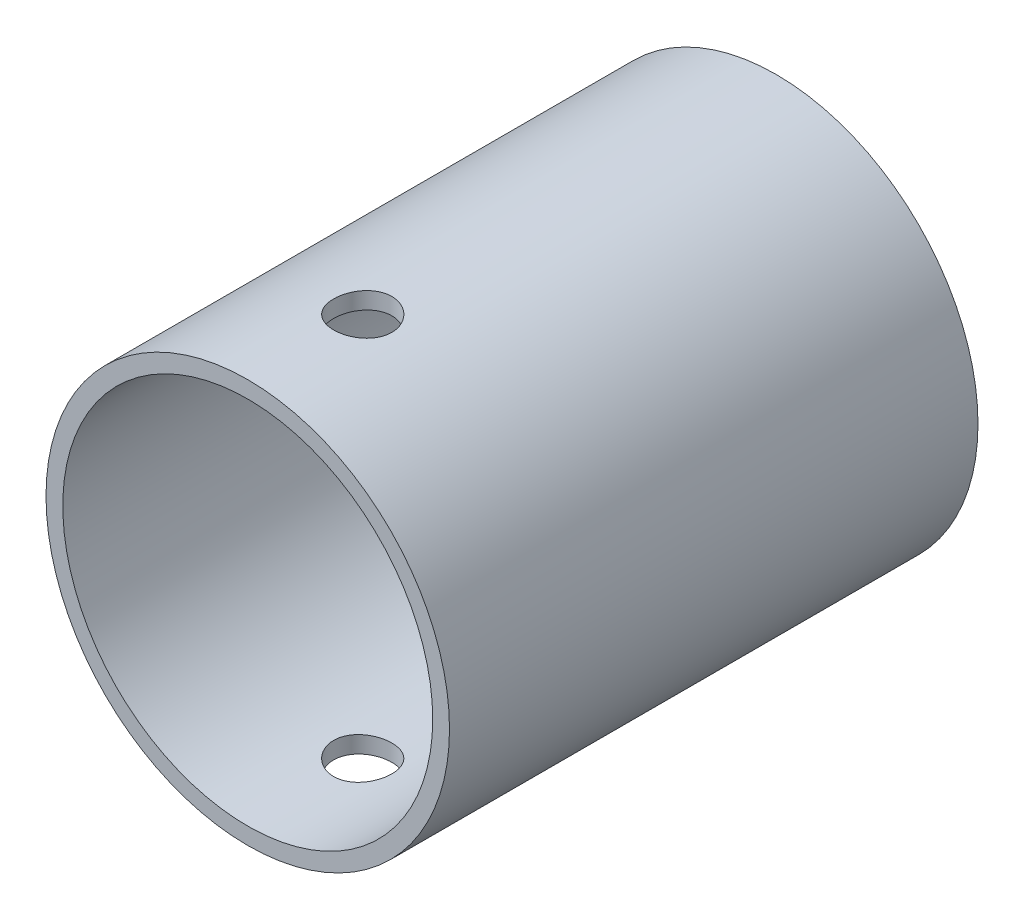
ISO-10303-21;
HEADER;
FILE_DESCRIPTION(('STEP AP214'),'2;1');
FILE_NAME('part.step','',(''),(''),'','','');
FILE_SCHEMA(('AUTOMOTIVE_DESIGN { 1 0 10303 214 1 1 1 1 }'));
ENDSEC;
DATA;
#1=APPLICATION_CONTEXT('core data for automotive mechanical design processes');
#2=APPLICATION_PROTOCOL_DEFINITION('international standard','automotive_design',2000,#1);
#3=PRODUCT_CONTEXT('',#1,'mechanical');
#4=PRODUCT('Part','Part','',(#3));
#5=PRODUCT_RELATED_PRODUCT_CATEGORY('part','',(#4));
#6=PRODUCT_DEFINITION_FORMATION('','',#4);
#7=PRODUCT_DEFINITION_CONTEXT('part definition',#1,'design');
#8=PRODUCT_DEFINITION('design','',#6,#7);
#9=PRODUCT_DEFINITION_SHAPE('','',#8);
#10=(LENGTH_UNIT() NAMED_UNIT(*) SI_UNIT(.MILLI.,.METRE.));
#11=(NAMED_UNIT(*) PLANE_ANGLE_UNIT() SI_UNIT($,.RADIAN.));
#12=(NAMED_UNIT(*) SI_UNIT($,.STERADIAN.) SOLID_ANGLE_UNIT());
#13=UNCERTAINTY_MEASURE_WITH_UNIT(LENGTH_MEASURE(1.E-05),#10,'distance_accuracy_value','');
#14=(GEOMETRIC_REPRESENTATION_CONTEXT(3) GLOBAL_UNCERTAINTY_ASSIGNED_CONTEXT((#13)) GLOBAL_UNIT_ASSIGNED_CONTEXT((#10,
#11,#12)) REPRESENTATION_CONTEXT('',''));
#15=CARTESIAN_POINT('',(0.,0.,0.));
#16=DIRECTION('',(0.,0.,1.));
#17=DIRECTION('',(1.,0.,0.));
#18=AXIS2_PLACEMENT_3D('',#15,#16,#17);
#19=CARTESIAN_POINT('',(0.,0.,6.));
#20=DIRECTION('',(0.,0.,1.));
#21=DIRECTION('',(1.,0.,0.));
#22=AXIS2_PLACEMENT_3D('',#19,#20,#21);
#23=PLANE('',#22);
#24=CARTESIAN_POINT('',(0.,0.,6.));
#25=DIRECTION('',(0.,0.,1.));
#26=DIRECTION('',(1.,0.,0.));
#27=AXIS2_PLACEMENT_3D('',#24,#25,#26);
#28=CIRCLE('',#27,9.);
#29=CARTESIAN_POINT('',(9.,0.,6.));
#30=VERTEX_POINT('',#29);
#31=EDGE_CURVE('E141',#30,#30,#28,.T.);
#32=ORIENTED_EDGE('',*,*,#31,.F.);
#33=EDGE_LOOP('',(#32));
#34=FACE_BOUND('',#33,.T.);
#35=CARTESIAN_POINT('',(0.,0.,6.));
#36=DIRECTION('',(0.,0.,1.));
#37=DIRECTION('',(1.,0.,0.));
#38=AXIS2_PLACEMENT_3D('',#35,#36,#37);
#39=CIRCLE('',#38,10.);
#40=CARTESIAN_POINT('',(10.,0.,6.));
#41=VERTEX_POINT('',#40);
#42=EDGE_CURVE('E61',#41,#41,#39,.F.);
#43=ORIENTED_EDGE('',*,*,#42,.F.);
#44=EDGE_LOOP('',(#43));
#45=FACE_BOUND('',#44,.T.);
#46=ADVANCED_FACE('F36',(#34,#45),#23,.T.);
#47=CARTESIAN_POINT('',(0.,0.,5.));
#48=DIRECTION('',(0.,0.,-1.));
#49=DIRECTION('',(-1.,0.,0.));
#50=AXIS2_PLACEMENT_3D('',#47,#48,#49);
#51=PLANE('',#50);
#52=CARTESIAN_POINT('',(0.,0.,5.));
#53=DIRECTION('',(0.,0.,-1.));
#54=DIRECTION('',(-1.,0.,0.));
#55=AXIS2_PLACEMENT_3D('',#52,#53,#54);
#56=CIRCLE('',#55,6.);
#57=CARTESIAN_POINT('',(-6.,0.,5.));
#58=VERTEX_POINT('',#57);
#59=EDGE_CURVE('E136',#58,#58,#56,.T.);
#60=ORIENTED_EDGE('',*,*,#59,.T.);
#61=EDGE_LOOP('',(#60));
#62=FACE_BOUND('',#61,.T.);
#63=CARTESIAN_POINT('',(0.,0.,5.));
#64=DIRECTION('',(0.,0.,1.));
#65=DIRECTION('',(1.,0.,0.));
#66=AXIS2_PLACEMENT_3D('',#63,#64,#65);
#67=CIRCLE('',#66,9.);
#68=CARTESIAN_POINT('',(9.,0.,5.));
#69=VERTEX_POINT('',#68);
#70=EDGE_CURVE('E149',#69,#69,#67,.T.);
#71=ORIENTED_EDGE('',*,*,#70,.T.);
#72=EDGE_LOOP('',(#71));
#73=FACE_BOUND('',#72,.T.);
#74=ADVANCED_FACE('F100',(#62,#73),#51,.F.);
#75=CARTESIAN_POINT('',(0.,0.,50.));
#76=DIRECTION('',(0.,0.,-1.));
#77=DIRECTION('',(-1.,0.,0.));
#78=AXIS2_PLACEMENT_3D('',#75,#76,#77);
#79=CYLINDRICAL_SURFACE('',#78,17.5);
#80=CARTESIAN_POINT('',(0.,-17.5,41.8700003922223));
#81=CARTESIAN_POINT('',(0.153455229582551,-17.4999974630045,41.8699941337384));
#82=CARTESIAN_POINT('',(0.306997303591635,-17.4979604565219,41.8571123767081));
#83=CARTESIAN_POINT('',(0.609783625449626,-17.4900305238574,41.8059422330934));
#84=CARTESIAN_POINT('',(0.759023644274631,-17.4841339300814,41.767629680265));
#85=CARTESIAN_POINT('',(1.04878062656791,-17.469146941984,41.6667761464509));
#86=CARTESIAN_POINT('',(1.18930431030421,-17.4600590450865,41.6042541072099));
#87=CARTESIAN_POINT('',(1.4578461688781,-17.4396915891876,41.4568040653463));
#88=CARTESIAN_POINT('',(1.58586594948107,-17.4284123121633,41.3718789449507));
#89=CARTESIAN_POINT('',(1.82687936824554,-17.4048070423709,41.1812611533715));
#90=CARTESIAN_POINT('',(1.93975072674967,-17.3924737106769,41.0754147665861));
#91=CARTESIAN_POINT('',(2.14620776085764,-17.368207284657,40.8462898676752));
#92=CARTESIAN_POINT('',(2.23979228333447,-17.3562742142977,40.723010313993));
#93=CARTESIAN_POINT('',(2.40550105052376,-17.3340882849669,40.4616891842459));
#94=CARTESIAN_POINT('',(2.47750588810652,-17.3238449109296,40.323571014526));
#95=CARTESIAN_POINT('',(2.59724804353714,-17.3062990761218,40.0370128344823));
#96=CARTESIAN_POINT('',(2.64498681482154,-17.2989964392188,39.8885734429624));
#97=CARTESIAN_POINT('',(2.71445962258402,-17.2882314601016,39.5868768602009));
#98=CARTESIAN_POINT('',(2.73640375950366,-17.2847381079426,39.4336691765623));
#99=CARTESIAN_POINT('',(2.75431548537907,-17.281893232641,39.12570940022));
#100=CARTESIAN_POINT('',(2.75028470959802,-17.2825414487639,38.9709574053517));
#101=CARTESIAN_POINT('',(2.71653249105086,-17.2878781308041,38.665792501426));
#102=CARTESIAN_POINT('',(2.68704588428737,-17.2925296639804,38.5153528794389));
#103=CARTESIAN_POINT('',(2.60358701785442,-17.3052911276942,38.221583204165));
#104=CARTESIAN_POINT('',(2.54961400397372,-17.3134011647574,38.0782533700192));
#105=CARTESIAN_POINT('',(2.41847274313756,-17.3322062618977,37.8020621568788));
#106=CARTESIAN_POINT('',(2.3412058407861,-17.3429122780869,37.669248398068));
#107=CARTESIAN_POINT('',(2.16574029562039,-17.3656952499611,37.4183824011052));
#108=CARTESIAN_POINT('',(2.06754014737257,-17.3777723042165,37.3003312255872));
#109=CARTESIAN_POINT('',(1.85171057236304,-17.4020993832948,37.0809811054065));
#110=CARTESIAN_POINT('',(1.7338794134433,-17.4143498500481,36.979880598823));
#111=CARTESIAN_POINT('',(1.48281796103276,-17.4375203725031,36.798858256409));
#112=CARTESIAN_POINT('',(1.34958758767357,-17.4484404213039,36.7189365304298));
#113=CARTESIAN_POINT('',(1.07133156137927,-17.4677327717946,36.5825269724027));
#114=CARTESIAN_POINT('',(0.926297820339916,-17.4761033075165,36.5260553737314));
#115=CARTESIAN_POINT('',(0.628644132738795,-17.4893389966959,36.4383264400927));
#116=CARTESIAN_POINT('',(0.476024750473814,-17.4942044104837,36.4070672325438));
#117=CARTESIAN_POINT('',(0.169243780415673,-17.4998469580502,36.3709164208083));
#118=CARTESIAN_POINT('',(0.0151150703929344,-17.5006663632781,36.3657521711964));
#119=CARTESIAN_POINT('',(-0.29180648376779,-17.4982399319457,36.3812128531373));
#120=CARTESIAN_POINT('',(-0.4445993732436,-17.4949942338987,36.401836905985));
#121=CARTESIAN_POINT('',(-0.743679422530946,-17.4848284353516,36.4680620039074));
#122=CARTESIAN_POINT('',(-0.889996919858359,-17.4779280136421,36.5135293219911));
#123=CARTESIAN_POINT('',(-1.17293227179733,-17.4612237098417,36.628008640138));
#124=CARTESIAN_POINT('',(-1.30954963259971,-17.4514196800667,36.697021837825));
#125=CARTESIAN_POINT('',(-1.57039946776912,-17.4298918578239,36.8572671921913));
#126=CARTESIAN_POINT('',(-1.69452514146822,-17.4181534584848,36.9486712014796));
#127=CARTESIAN_POINT('',(-1.92577278652917,-17.3941064929383,37.1508654890616));
#128=CARTESIAN_POINT('',(-2.03289366682977,-17.3817978902109,37.2616570103385));
#129=CARTESIAN_POINT('',(-2.22809077542299,-17.3578626272195,37.5006989512705));
#130=CARTESIAN_POINT('',(-2.31598362633745,-17.3462432437313,37.6290999545737));
#131=CARTESIAN_POINT('',(-2.46895256595108,-17.3251337935183,37.8990037750657));
#132=CARTESIAN_POINT('',(-2.53402931720837,-17.3156436649648,38.0405062116502));
#133=CARTESIAN_POINT('',(-2.63923867768394,-17.2999207265537,38.3320635521373));
#134=CARTESIAN_POINT('',(-2.67946560939592,-17.2936756141117,38.4820837264695));
#135=CARTESIAN_POINT('',(-2.73413229043844,-17.285117855811,38.7868569262007));
#136=CARTESIAN_POINT('',(-2.74857401062851,-17.2828049094027,38.9416095889583));
#137=CARTESIAN_POINT('',(-2.75121005923864,-17.2823853149773,39.2496257804446));
#138=CARTESIAN_POINT('',(-2.73969283943861,-17.2842324406975,39.4028868548955));
#139=CARTESIAN_POINT('',(-2.69135840320221,-17.2918240499717,39.7052627646104));
#140=CARTESIAN_POINT('',(-2.65454124370756,-17.297568524754,39.8543776092054));
#141=CARTESIAN_POINT('',(-2.55675761537021,-17.3122908254171,40.1441351076097));
#142=CARTESIAN_POINT('',(-2.49581326154319,-17.3212656896368,40.2847853844235));
#143=CARTESIAN_POINT('',(-2.35153428014303,-17.3414408094226,40.5539115750985));
#144=CARTESIAN_POINT('',(-2.2681987464252,-17.3526411550466,40.6823869959729));
#145=CARTESIAN_POINT('',(-2.08046265805288,-17.3761530141985,40.9249787203767));
#146=CARTESIAN_POINT('',(-1.97584903731687,-17.3884750087046,41.0389291422424));
#147=CARTESIAN_POINT('',(-1.74897653539545,-17.4127559241292,41.2477584911066));
#148=CARTESIAN_POINT('',(-1.62671357218263,-17.4247147602782,41.3426329939518));
#149=CARTESIAN_POINT('',(-1.36713472210832,-17.4470054845769,41.5111377614422));
#150=CARTESIAN_POINT('',(-1.22973187787683,-17.4573270446582,41.5846354278861));
#151=CARTESIAN_POINT('',(-0.944429950548835,-17.4750794072139,41.7073966727562));
#152=CARTESIAN_POINT('',(-0.796541742404635,-17.4825131544018,41.7566849512202));
#153=CARTESIAN_POINT('',(-0.540021805161799,-17.491986366102,41.8186469990022));
#154=CARTESIAN_POINT('',(-0.432960829499724,-17.4949757850587,41.837874509043));
#155=CARTESIAN_POINT('',(-0.217281069280105,-17.4989834861277,41.8635533300353));
#156=CARTESIAN_POINT('',(-0.108662307045458,-17.5000017964574,41.8700048238817));
#157=CARTESIAN_POINT('',(0.,-17.5,41.8700003922223));
#158=B_SPLINE_CURVE_WITH_KNOTS('',3,(#80,#81,#82,#83,#84,#85,#86,#87,#88,#89,#90,#91,#92,#93,
#94,#95,#96,#97,#98,#99,#100,#101,#102,#103,#104,#105,#106,#107,#108,#109,#110,#111,#112,#113,
#114,#115,#116,#117,#118,#119,#120,#121,#122,#123,#124,#125,#126,#127,#128,#129,#130,#131,#132,
#133,#134,#135,#136,#137,#138,#139,#140,#141,#142,#143,#144,#145,#146,#147,#148,#149,#150,#151,
#152,#153,#154,#155,#156,#157),.UNSPECIFIED.,.T.,.F.,(4,2,2,2,2,2,2,2,2,2,2,2,2,2,2,2,2,2,2,2,2,
2,2,2,2,2,2,2,2,2,2,2,2,2,2,2,2,2,4),(0.,0.459968572164253,0.920374867822618,1.38042166249811,
1.84040929954923,2.30391144436546,2.76744129314947,3.2334905525743,3.69951189429492,
4.1617105385927,4.62388008523577,5.08183102452064,5.5397960702116,5.99972863003873,
6.45969427750327,6.92471667887331,7.38974149220079,7.85508768497432,8.320399312248,
8.78083906741796,9.24126313409204,9.69923288986304,10.1572259430135,10.6188507976519,
11.0805052590953,11.546387163941,12.0122555388924,12.4763445730229,12.9403981335855,
13.3993206543928,13.8582421423223,14.3167439525829,14.7752643206676,15.2386245857692,
15.7020921913456,16.1683761500298,16.6341833812816,16.9598937651968,17.2855994863752),.UNSPECIFIED.);
#159=CARTESIAN_POINT('',(0.,-17.5,41.8700003922223));
#160=VERTEX_POINT('',#159);
#161=EDGE_CURVE('E89',#160,#160,#158,.T.);
#162=ORIENTED_EDGE('',*,*,#161,.F.);
#163=EDGE_LOOP('',(#162));
#164=FACE_BOUND('',#163,.T.);
#165=CARTESIAN_POINT('',(0.,17.5,36.3700003922224));
#166=CARTESIAN_POINT('',(0.153455229582551,17.4999974630045,36.3700066507063));
#167=CARTESIAN_POINT('',(0.306997303591635,17.4979604565219,36.3828884077366));
#168=CARTESIAN_POINT('',(0.609783625449626,17.4900305238574,36.4340585513513));
#169=CARTESIAN_POINT('',(0.759023644274631,17.4841339300814,36.4723711041797));
#170=CARTESIAN_POINT('',(1.04878062656791,17.469146941984,36.5732246379938));
#171=CARTESIAN_POINT('',(1.18930431030421,17.4600590450865,36.6357466772348));
#172=CARTESIAN_POINT('',(1.4578461688781,17.4396915891876,36.7831967190983));
#173=CARTESIAN_POINT('',(1.58586594948107,17.4284123121633,36.868121839494));
#174=CARTESIAN_POINT('',(1.82687936824554,17.4048070423709,37.0587396310732));
#175=CARTESIAN_POINT('',(1.93975072674967,17.3924737106769,37.1645860178586));
#176=CARTESIAN_POINT('',(2.14620776085764,17.368207284657,37.3937109167695));
#177=CARTESIAN_POINT('',(2.23979228333447,17.3562742142977,37.5169904704517));
#178=CARTESIAN_POINT('',(2.40550105052376,17.3340882849669,37.7783116001988));
#179=CARTESIAN_POINT('',(2.47750588810652,17.3238449109296,37.9164297699187));
#180=CARTESIAN_POINT('',(2.59724804353714,17.3062990761218,38.2029879499624));
#181=CARTESIAN_POINT('',(2.64498681482154,17.2989964392188,38.3514273414823));
#182=CARTESIAN_POINT('',(2.71445962258402,17.2882314601016,38.6531239242438));
#183=CARTESIAN_POINT('',(2.73640375950366,17.2847381079426,38.8063316078824));
#184=CARTESIAN_POINT('',(2.75431548537907,17.281893232641,39.1142913842247));
#185=CARTESIAN_POINT('',(2.75028470959802,17.2825414487639,39.269043379093));
#186=CARTESIAN_POINT('',(2.71653249105086,17.2878781308041,39.5742082830187));
#187=CARTESIAN_POINT('',(2.68704588428737,17.2925296639804,39.7246479050058));
#188=CARTESIAN_POINT('',(2.60358701785442,17.3052911276942,40.0184175802797));
#189=CARTESIAN_POINT('',(2.54961400397372,17.3134011647574,40.1617474144255));
#190=CARTESIAN_POINT('',(2.41847274313756,17.3322062618977,40.4379386275659));
#191=CARTESIAN_POINT('',(2.3412058407861,17.3429122780869,40.5707523863767));
#192=CARTESIAN_POINT('',(2.16574029562039,17.3656952499611,40.8216183833395));
#193=CARTESIAN_POINT('',(2.06754014737257,17.3777723042165,40.9396695588575));
#194=CARTESIAN_POINT('',(1.85171057236304,17.4020993832948,41.1590196790382));
#195=CARTESIAN_POINT('',(1.7338794134433,17.4143498500481,41.2601201856217));
#196=CARTESIAN_POINT('',(1.48281796103276,17.4375203725031,41.4411425280357));
#197=CARTESIAN_POINT('',(1.34958758767357,17.4484404213039,41.5210642540149));
#198=CARTESIAN_POINT('',(1.07133156137927,17.4677327717946,41.657473812042));
#199=CARTESIAN_POINT('',(0.926297820339916,17.4761033075165,41.7139454107133));
#200=CARTESIAN_POINT('',(0.628644132738795,17.4893389966959,41.801674344352));
#201=CARTESIAN_POINT('',(0.476024750473814,17.4942044104837,41.8329335519009));
#202=CARTESIAN_POINT('',(0.169243780415673,17.4998469580502,41.8690843636364));
#203=CARTESIAN_POINT('',(0.0151150703929341,17.5006663632781,41.8742486132482));
#204=CARTESIAN_POINT('',(-0.29180648376779,17.4982399319457,41.8587879313074));
#205=CARTESIAN_POINT('',(-0.4445993732436,17.4949942338987,41.8381638784597));
#206=CARTESIAN_POINT('',(-0.743679422530946,17.4848284353516,41.7719387805373));
#207=CARTESIAN_POINT('',(-0.889996919858359,17.4779280136421,41.7264714624536));
#208=CARTESIAN_POINT('',(-1.17293227179733,17.4612237098417,41.6119921443067));
#209=CARTESIAN_POINT('',(-1.30954963259971,17.4514196800667,41.5429789466197));
#210=CARTESIAN_POINT('',(-1.57039946776912,17.4298918578239,41.3827335922534));
#211=CARTESIAN_POINT('',(-1.69452514146822,17.4181534584848,41.2913295829651));
#212=CARTESIAN_POINT('',(-1.92577278652918,17.3941064929383,41.0891352953831));
#213=CARTESIAN_POINT('',(-2.03289366682977,17.3817978902109,40.9783437741062));
#214=CARTESIAN_POINT('',(-2.22809077542299,17.3578626272195,40.7393018331742));
#215=CARTESIAN_POINT('',(-2.31598362633745,17.3462432437313,40.610900829871));
#216=CARTESIAN_POINT('',(-2.46895256595108,17.3251337935183,40.340997009379));
#217=CARTESIAN_POINT('',(-2.53402931720837,17.3156436649648,40.1994945727945));
#218=CARTESIAN_POINT('',(-2.63923867768394,17.2999207265537,39.9079372323074));
#219=CARTESIAN_POINT('',(-2.67946560939592,17.2936756141117,39.7579170579752));
#220=CARTESIAN_POINT('',(-2.73413229043844,17.285117855811,39.453143858244));
#221=CARTESIAN_POINT('',(-2.74857401062851,17.2828049094027,39.2983911954864));
#222=CARTESIAN_POINT('',(-2.75121005923864,17.2823853149773,38.9903750040001));
#223=CARTESIAN_POINT('',(-2.73969283943861,17.2842324406975,38.8371139295492));
#224=CARTESIAN_POINT('',(-2.69135840320221,17.2918240499717,38.5347380198343));
#225=CARTESIAN_POINT('',(-2.65454124370756,17.297568524754,38.3856231752393));
#226=CARTESIAN_POINT('',(-2.55675761537021,17.3122908254171,38.095865676835));
#227=CARTESIAN_POINT('',(-2.49581326154319,17.3212656896368,37.9552154000212));
#228=CARTESIAN_POINT('',(-2.35153428014303,17.3414408094226,37.6860892093462));
#229=CARTESIAN_POINT('',(-2.2681987464252,17.3526411550466,37.5576137884718));
#230=CARTESIAN_POINT('',(-2.08046265805288,17.3761530141985,37.315022064068));
#231=CARTESIAN_POINT('',(-1.97584903731687,17.3884750087046,37.2010716422023));
#232=CARTESIAN_POINT('',(-1.74897653539545,17.4127559241292,36.9922422933381));
#233=CARTESIAN_POINT('',(-1.62671357218263,17.4247147602782,36.8973677904929));
#234=CARTESIAN_POINT('',(-1.36713472210832,17.4470054845769,36.7288630230025));
#235=CARTESIAN_POINT('',(-1.22973187787683,17.4573270446582,36.6553653565586));
#236=CARTESIAN_POINT('',(-0.944429950548835,17.4750794072139,36.5326041116885));
#237=CARTESIAN_POINT('',(-0.796541742404635,17.4825131544018,36.4833158332245));
#238=CARTESIAN_POINT('',(-0.540021805161799,17.491986366102,36.4213537854425));
#239=CARTESIAN_POINT('',(-0.432960829499724,17.4949757850587,36.4021262754017));
#240=CARTESIAN_POINT('',(-0.217281069280105,17.4989834861277,36.3764474544094));
#241=CARTESIAN_POINT('',(-0.108662307045458,17.5000017964574,36.369995960563));
#242=CARTESIAN_POINT('',(0.,17.5,36.3700003922224));
#243=B_SPLINE_CURVE_WITH_KNOTS('',3,(#165,#166,#167,#168,#169,#170,#171,#172,#173,#174,#175,
#176,#177,#178,#179,#180,#181,#182,#183,#184,#185,#186,#187,#188,#189,#190,#191,#192,#193,#194,
#195,#196,#197,#198,#199,#200,#201,#202,#203,#204,#205,#206,#207,#208,#209,#210,#211,#212,#213,
#214,#215,#216,#217,#218,#219,#220,#221,#222,#223,#224,#225,#226,#227,#228,#229,#230,#231,#232,
#233,#234,#235,#236,#237,#238,#239,#240,#241,#242),.UNSPECIFIED.,.T.,.F.,(4,2,2,2,2,2,2,2,2,2,2,
2,2,2,2,2,2,2,2,2,2,2,2,2,2,2,2,2,2,2,2,2,2,2,2,2,2,2,4),(0.,0.459968572164253,
0.920374867822618,1.38042166249811,1.84040929954923,2.30391144436546,2.76744129314947,
3.2334905525743,3.69951189429492,4.16171053859271,4.62388008523577,5.08183102452064,
5.5397960702116,5.99972863003873,6.45969427750327,6.92471667887331,7.38974149220079,
7.85508768497432,8.320399312248,8.78083906741796,9.24126313409204,9.69923288986304,
10.1572259430135,10.6188507976519,11.0805052590953,11.546387163941,12.0122555388924,
12.4763445730229,12.9403981335855,13.3993206543928,13.8582421423222,14.3167439525829,
14.7752643206676,15.2386245857692,15.7020921913456,16.1683761500298,16.6341833812816,
16.9598937651968,17.2855994863752),.UNSPECIFIED.);
#244=CARTESIAN_POINT('',(0.,17.5,36.3700003922224));
#245=VERTEX_POINT('',#244);
#246=EDGE_CURVE('E79',#245,#245,#243,.T.);
#247=ORIENTED_EDGE('',*,*,#246,.F.);
#248=EDGE_LOOP('',(#247));
#249=FACE_BOUND('',#248,.T.);
#250=CARTESIAN_POINT('',(0.,0.,18.));
#251=DIRECTION('',(0.,0.,1.));
#252=DIRECTION('',(1.,0.,0.));
#253=AXIS2_PLACEMENT_3D('',#250,#251,#252);
#254=CIRCLE('',#253,17.5);
#255=CARTESIAN_POINT('',(17.5,0.,18.));
#256=VERTEX_POINT('',#255);
#257=EDGE_CURVE('E55',#256,#256,#254,.T.);
#258=ORIENTED_EDGE('',*,*,#257,.F.);
#259=EDGE_LOOP('',(#258));
#260=FACE_BOUND('',#259,.T.);
#261=CARTESIAN_POINT('',(0.,0.,50.));
#262=DIRECTION('',(0.,0.,1.));
#263=DIRECTION('',(1.,0.,0.));
#264=AXIS2_PLACEMENT_3D('',#261,#262,#263);
#265=CIRCLE('',#264,17.5);
#266=CARTESIAN_POINT('',(17.5,0.,50.));
#267=VERTEX_POINT('',#266);
#268=EDGE_CURVE('E146',#267,#267,#265,.T.);
#269=ORIENTED_EDGE('',*,*,#268,.T.);
#270=EDGE_LOOP('',(#269));
#271=FACE_BOUND('',#270,.T.);
#272=ADVANCED_FACE('F94',(#164,#249,#260,#271),#79,.F.);
#273=CARTESIAN_POINT('',(0.,0.,50.));
#274=DIRECTION('',(0.,0.,1.));
#275=DIRECTION('',(1.,0.,0.));
#276=AXIS2_PLACEMENT_3D('',#273,#274,#275);
#277=PLANE('',#276);
#278=CARTESIAN_POINT('',(0.,0.,50.));
#279=DIRECTION('',(0.,0.,1.));
#280=DIRECTION('',(1.,0.,0.));
#281=AXIS2_PLACEMENT_3D('',#278,#279,#280);
#282=CIRCLE('',#281,19.0875);
#283=CARTESIAN_POINT('',(19.0875,0.,50.));
#284=VERTEX_POINT('',#283);
#285=EDGE_CURVE('E156',#284,#284,#282,.T.);
#286=ORIENTED_EDGE('',*,*,#285,.T.);
#287=EDGE_LOOP('',(#286));
#288=FACE_BOUND('',#287,.T.);
#289=ORIENTED_EDGE('',*,*,#268,.F.);
#290=EDGE_LOOP('',(#289));
#291=FACE_BOUND('',#290,.T.);
#292=ADVANCED_FACE('F99',(#288,#291),#277,.T.);
#293=CARTESIAN_POINT('',(0.,0.,0.));
#294=DIRECTION('',(0.,0.,1.));
#295=DIRECTION('',(1.,0.,0.));
#296=AXIS2_PLACEMENT_3D('',#293,#294,#295);
#297=PLANE('',#296);
#298=CARTESIAN_POINT('',(0.,0.,0.));
#299=DIRECTION('',(0.,0.,1.));
#300=DIRECTION('',(1.,0.,0.));
#301=AXIS2_PLACEMENT_3D('',#298,#299,#300);
#302=CIRCLE('',#301,19.0875);
#303=CARTESIAN_POINT('',(19.0875,0.,0.));
#304=VERTEX_POINT('',#303);
#305=EDGE_CURVE('E155',#304,#304,#302,.T.);
#306=ORIENTED_EDGE('',*,*,#305,.F.);
#307=EDGE_LOOP('',(#306));
#308=FACE_BOUND('',#307,.T.);
#309=CARTESIAN_POINT('',(0.,0.,0.));
#310=DIRECTION('',(0.,0.,-1.));
#311=DIRECTION('',(-1.,0.,0.));
#312=AXIS2_PLACEMENT_3D('',#309,#310,#311);
#313=CIRCLE('',#312,6.);
#314=CARTESIAN_POINT('',(-6.,0.,0.));
#315=VERTEX_POINT('',#314);
#316=EDGE_CURVE('E139',#315,#315,#313,.T.);
#317=ORIENTED_EDGE('',*,*,#316,.F.);
#318=EDGE_LOOP('',(#317));
#319=FACE_BOUND('',#318,.T.);
#320=ADVANCED_FACE('F105',(#308,#319),#297,.F.);
#321=CARTESIAN_POINT('',(0.,0.,50.));
#322=DIRECTION('',(0.,0.,-1.));
#323=DIRECTION('',(-1.,0.,0.));
#324=AXIS2_PLACEMENT_3D('',#321,#322,#323);
#325=CYLINDRICAL_SURFACE('',#324,19.0875);
#326=CARTESIAN_POINT('',(0.,-19.0875,41.8700003922223));
#327=CARTESIAN_POINT('',(0.153615521120521,-19.0874976073508,41.8699940048672));
#328=CARTESIAN_POINT('',(0.307321919414108,-19.0856260886995,41.8570854631101));
#329=CARTESIAN_POINT('',(0.61044325138344,-19.078340322224,41.805802666711));
#330=CARTESIAN_POINT('',(0.759853776449987,-19.0729225616853,41.7674031615706));
#331=CARTESIAN_POINT('',(1.0499523272757,-19.0591535274818,41.6663055363477));
#332=CARTESIAN_POINT('',(1.19064667632898,-19.0508044104449,41.6036252763626));
#333=CARTESIAN_POINT('',(1.45949743002485,-19.0320967554129,41.4557879426475));
#334=CARTESIAN_POINT('',(1.58765567505141,-19.021738513039,41.3706341749872));
#335=CARTESIAN_POINT('',(1.82874567934008,-19.0000819023628,41.1796105408404));
#336=CARTESIAN_POINT('',(1.94157367862009,-18.9887778907905,41.0736103454498));
#337=CARTESIAN_POINT('',(2.14790558010967,-18.9665482758457,40.8441831727678));
#338=CARTESIAN_POINT('',(2.24140840443123,-18.955622693609,40.7207552240657));
#339=CARTESIAN_POINT('',(2.4068354982899,-18.9353320845211,40.4592845205804));
#340=CARTESIAN_POINT('',(2.47866014359806,-18.9259743478301,40.3211781208939));
#341=CARTESIAN_POINT('',(2.59805550551329,-18.909955444476,40.0347050370253));
#342=CARTESIAN_POINT('',(2.64562744099076,-18.9032941423016,39.8863388688949));
#343=CARTESIAN_POINT('',(2.71484640117386,-18.893477480035,39.5846458082018));
#344=CARTESIAN_POINT('',(2.73667050797301,-18.8902981832464,39.4313603374033));
#345=CARTESIAN_POINT('',(2.75432273116317,-18.8877327117754,39.1232723717038));
#346=CARTESIAN_POINT('',(2.75015222628334,-18.8883463359202,38.9684699576946));
#347=CARTESIAN_POINT('',(2.71607848744068,-18.8932754787945,38.6629890180054));
#348=CARTESIAN_POINT('',(2.68637192683781,-18.8975627034194,38.5122880330407));
#349=CARTESIAN_POINT('',(2.60237695257479,-18.9093118080741,38.2180322253942));
#350=CARTESIAN_POINT('',(2.54808789299907,-18.9167737715212,38.0744775905959));
#351=CARTESIAN_POINT('',(2.41626271289395,-18.93406304825,37.797987897475));
#352=CARTESIAN_POINT('',(2.33864274217743,-18.9438988675002,37.6650933710295));
#353=CARTESIAN_POINT('',(2.16241886697989,-18.9648213615543,37.4141409888064));
#354=CARTESIAN_POINT('',(2.06381369054991,-18.9759081121601,37.2960840330492));
#355=CARTESIAN_POINT('',(1.84733623711265,-18.9982084901695,37.0770177086298));
#356=CARTESIAN_POINT('',(1.72929475592141,-19.0094223451599,36.9761754926198));
#357=CARTESIAN_POINT('',(1.47787363335214,-19.03061834793,36.7957081354773));
#358=CARTESIAN_POINT('',(1.34449393387797,-19.0406004910441,36.7160830747123));
#359=CARTESIAN_POINT('',(1.06604169691755,-19.0582176396214,36.5803038517239));
#360=CARTESIAN_POINT('',(0.92096308857828,-19.0658514164373,36.5241619702138));
#361=CARTESIAN_POINT('',(0.623302710085163,-19.0779012587909,36.4370848757042));
#362=CARTESIAN_POINT('',(0.470721408171616,-19.0823175248607,36.4061480917759));
#363=CARTESIAN_POINT('',(0.163830171900698,-19.0874083216805,36.370580216214));
#364=CARTESIAN_POINT('',(0.00954740629092863,-19.0881155545185,36.3657192089349));
#365=CARTESIAN_POINT('',(-0.297630929524714,-19.0857974343763,36.3818314952901));
#366=CARTESIAN_POINT('',(-0.450526539131832,-19.0827721877512,36.4028040528103));
#367=CARTESIAN_POINT('',(-0.749898553796234,-19.0733492726509,36.4697969851133));
#368=CARTESIAN_POINT('',(-0.896400402884331,-19.0669666084194,36.5157059490332));
#369=CARTESIAN_POINT('',(-1.17962713880169,-19.0515424738158,36.6311514399829));
#370=CARTESIAN_POINT('',(-1.31635159731462,-19.0425008870535,36.7006890013397));
#371=CARTESIAN_POINT('',(-1.5771574665485,-19.0226830922841,36.8619614260365));
#372=CARTESIAN_POINT('',(-1.70114736709116,-19.0118955942081,36.9538428649641));
#373=CARTESIAN_POINT('',(-1.93202921337457,-18.9898234846501,37.1569899723744));
#374=CARTESIAN_POINT('',(-2.03892024564451,-18.9785388466503,37.2682566758108));
#375=CARTESIAN_POINT('',(-2.2334014519783,-18.9566413067788,37.5080367511314));
#376=CARTESIAN_POINT('',(-2.32083792662726,-18.9460341957184,37.6366753942108));
#377=CARTESIAN_POINT('',(-2.4728613317025,-18.9267934310252,37.9069486693752));
#378=CARTESIAN_POINT('',(-2.53744884116329,-18.9181597273848,38.0485829720119));
#379=CARTESIAN_POINT('',(-2.6416999885292,-18.9038846687247,38.3403592839205));
#380=CARTESIAN_POINT('',(-2.68144596509198,-18.8982334379287,38.4904713694376));
#381=CARTESIAN_POINT('',(-2.73514871306011,-18.8905364169606,38.7953270816236));
#382=CARTESIAN_POINT('',(-2.74910711604136,-18.8884903986877,38.9500704146446));
#383=CARTESIAN_POINT('',(-2.75080191178507,-18.8882435222291,39.2582648625841));
#384=CARTESIAN_POINT('',(-2.73877990820919,-18.8900072355387,39.4117146754972));
#385=CARTESIAN_POINT('',(-2.68937134673422,-18.8971043105539,39.7143865284613));
#386=CARTESIAN_POINT('',(-2.65198481731345,-18.9024376682515,39.863608573259));
#387=CARTESIAN_POINT('',(-2.5529914660506,-18.9160610713229,40.1535308936064));
#388=CARTESIAN_POINT('',(-2.49140021928185,-18.9243492150551,40.2942365821416));
#389=CARTESIAN_POINT('',(-2.34576966984653,-18.9429508272684,40.5633561231066));
#390=CARTESIAN_POINT('',(-2.26172972649173,-18.953264353552,40.691769624574));
#391=CARTESIAN_POINT('',(-2.07270467337002,-18.974869052824,40.9338891873967));
#392=CARTESIAN_POINT('',(-1.96754028448335,-18.9861680904932,41.0474545967215));
#393=CARTESIAN_POINT('',(-1.73963002813365,-19.0084040647582,41.2554131894042));
#394=CARTESIAN_POINT('',(-1.61688006709496,-19.0193409163123,41.3498018963973));
#395=CARTESIAN_POINT('',(-1.3565560052711,-19.0396830230242,41.5171502173313));
#396=CARTESIAN_POINT('',(-1.21891004789264,-19.0490802495767,41.5899990010265));
#397=CARTESIAN_POINT('',(-0.933269184657702,-19.0652051265391,41.7114368200805));
#398=CARTESIAN_POINT('',(-0.785285318196399,-19.0719355749352,41.7600512960001));
#399=CARTESIAN_POINT('',(-0.530508906074504,-19.080410241401,41.8204565264275));
#400=CARTESIAN_POINT('',(-0.425298265725089,-19.0830554262534,41.8390075181438));
#401=CARTESIAN_POINT('',(-0.213406361091009,-19.0866011270885,41.8637816019122));
#402=CARTESIAN_POINT('',(-0.106725113031621,-19.0875016623044,41.8700048298677));
#403=CARTESIAN_POINT('',(0.,-19.0875,41.8700003922223));
#404=B_SPLINE_CURVE_WITH_KNOTS('',3,(#326,#327,#328,#329,#330,#331,#332,#333,#334,#335,#336,
#337,#338,#339,#340,#341,#342,#343,#344,#345,#346,#347,#348,#349,#350,#351,#352,#353,#354,#355,
#356,#357,#358,#359,#360,#361,#362,#363,#364,#365,#366,#367,#368,#369,#370,#371,#372,#373,#374,
#375,#376,#377,#378,#379,#380,#381,#382,#383,#384,#385,#386,#387,#388,#389,#390,#391,#392,#393,
#394,#395,#396,#397,#398,#399,#400,#401,#402,#403),.UNSPECIFIED.,.T.,.F.,(4,2,2,2,2,2,2,2,2,2,2,
2,2,2,2,2,2,2,2,2,2,2,2,2,2,2,2,2,2,2,2,2,2,2,2,2,2,2,4),(0.,0.460456617825209,0.92137003059068,
1.38194505293461,1.84245235798277,2.3059358668478,2.76944522016562,3.23505333277042,
3.7006380429633,4.16300164846519,4.62534073085565,5.08415055582128,5.54297243690893,
6.00346342962956,6.46398234144444,6.92874575399378,7.39351092697263,7.85851884959101,
8.32349778798203,8.78437008706609,9.24522925413426,9.70404613115434,10.1628830951827,
10.624815311634,11.0867721976,11.5522584710578,12.0177329473982,12.4816562844754,
12.9455502681874,13.4051488661451,13.864746948084,14.3240497741987,14.7833657102664,
15.2467583167256,15.7102589676787,16.1761045663354,16.6414600968217,16.9613680461405,
17.2812724687216),.UNSPECIFIED.);
#405=CARTESIAN_POINT('',(0.,-19.0875,41.8700003922223));
#406=VERTEX_POINT('',#405);
#407=EDGE_CURVE('E10',#406,#406,#404,.T.);
#408=ORIENTED_EDGE('',*,*,#407,.T.);
#409=EDGE_LOOP('',(#408));
#410=FACE_BOUND('',#409,.T.);
#411=CARTESIAN_POINT('',(0.,19.0875,36.3700003922224));
#412=CARTESIAN_POINT('',(0.153615521120521,19.0874976073508,36.3700067795775));
#413=CARTESIAN_POINT('',(0.307321919414108,19.0856260886995,36.3829153213346));
#414=CARTESIAN_POINT('',(0.61044325138344,19.078340322224,36.4341981177337));
#415=CARTESIAN_POINT('',(0.759853776449987,19.0729225616853,36.4725976228741));
#416=CARTESIAN_POINT('',(1.0499523272757,19.0591535274818,36.573695248097));
#417=CARTESIAN_POINT('',(1.19064667632898,19.0508044104449,36.6363755080821));
#418=CARTESIAN_POINT('',(1.45949743002485,19.0320967554129,36.7842128417972));
#419=CARTESIAN_POINT('',(1.58765567505141,19.021738513039,36.8693666094575));
#420=CARTESIAN_POINT('',(1.82874567934008,19.0000819023628,37.0603902436043));
#421=CARTESIAN_POINT('',(1.94157367862009,18.9887778907905,37.1663904389949));
#422=CARTESIAN_POINT('',(2.14790558010967,18.9665482758457,37.3958176116769));
#423=CARTESIAN_POINT('',(2.24140840443123,18.955622693609,37.5192455603789));
#424=CARTESIAN_POINT('',(2.4068354982899,18.9353320845211,37.7807162638643));
#425=CARTESIAN_POINT('',(2.47866014359806,18.9259743478301,37.9188226635508));
#426=CARTESIAN_POINT('',(2.59805550551329,18.909955444476,38.2052957474194));
#427=CARTESIAN_POINT('',(2.64562744099076,18.9032941423016,38.3536619155498));
#428=CARTESIAN_POINT('',(2.71484640117386,18.893477480035,38.6553549762429));
#429=CARTESIAN_POINT('',(2.73667050797301,18.8902981832464,38.8086404470414));
#430=CARTESIAN_POINT('',(2.75432273116317,18.8877327117754,39.1167284127409));
#431=CARTESIAN_POINT('',(2.75015222628334,18.8883463359202,39.2715308267501));
#432=CARTESIAN_POINT('',(2.71607848744068,18.8932754787945,39.5770117664392));
#433=CARTESIAN_POINT('',(2.68637192683781,18.8975627034194,39.727712751404));
#434=CARTESIAN_POINT('',(2.60237695257479,18.9093118080741,40.0219685590505));
#435=CARTESIAN_POINT('',(2.54808789299907,18.9167737715212,40.1655231938488));
#436=CARTESIAN_POINT('',(2.41626271289395,18.93406304825,40.4420128869697));
#437=CARTESIAN_POINT('',(2.33864274217743,18.9438988675002,40.5749074134152));
#438=CARTESIAN_POINT('',(2.16241886697989,18.9648213615543,40.8258597956383));
#439=CARTESIAN_POINT('',(2.06381369054991,18.9759081121601,40.9439167513954));
#440=CARTESIAN_POINT('',(1.84733623711265,18.9982084901695,41.1629830758149));
#441=CARTESIAN_POINT('',(1.72929475592141,19.0094223451599,41.2638252918249));
#442=CARTESIAN_POINT('',(1.47787363335214,19.03061834793,41.4442926489674));
#443=CARTESIAN_POINT('',(1.34449393387797,19.0406004910441,41.5239177097324));
#444=CARTESIAN_POINT('',(1.06604169691755,19.0582176396214,41.6596969327208));
#445=CARTESIAN_POINT('',(0.92096308857828,19.0658514164373,41.7158388142309));
#446=CARTESIAN_POINT('',(0.623302710085163,19.0779012587909,41.8029159087405));
#447=CARTESIAN_POINT('',(0.470721408171616,19.0823175248607,41.8338526926688));
#448=CARTESIAN_POINT('',(0.163830171900698,19.0874083216805,41.8694205682307));
#449=CARTESIAN_POINT('',(0.00954740629092863,19.0881155545185,41.8742815755098));
#450=CARTESIAN_POINT('',(-0.297630929524714,19.0857974343763,41.8581692891546));
#451=CARTESIAN_POINT('',(-0.450526539131832,19.0827721877512,41.8371967316344));
#452=CARTESIAN_POINT('',(-0.749898553796234,19.0733492726509,41.7702037993314));
#453=CARTESIAN_POINT('',(-0.896400402884331,19.0669666084194,41.7242948354115));
#454=CARTESIAN_POINT('',(-1.17962713880169,19.0515424738158,41.6088493444618));
#455=CARTESIAN_POINT('',(-1.31635159731462,19.0425008870535,41.539311783105));
#456=CARTESIAN_POINT('',(-1.5771574665485,19.0226830922841,41.3780393584082));
#457=CARTESIAN_POINT('',(-1.70114736709116,19.0118955942081,41.2861579194806));
#458=CARTESIAN_POINT('',(-1.93202921337457,18.9898234846501,41.0830108120703));
#459=CARTESIAN_POINT('',(-2.03892024564451,18.9785388466503,40.9717441086339));
#460=CARTESIAN_POINT('',(-2.2334014519783,18.9566413067788,40.7319640333133));
#461=CARTESIAN_POINT('',(-2.32083792662726,18.9460341957184,40.6033253902339));
#462=CARTESIAN_POINT('',(-2.4728613317025,18.9267934310252,40.3330521150695));
#463=CARTESIAN_POINT('',(-2.53744884116329,18.9181597273848,40.1914178124328));
#464=CARTESIAN_POINT('',(-2.6416999885292,18.9038846687247,39.8996415005242));
#465=CARTESIAN_POINT('',(-2.68144596509198,18.8982334379287,39.7495294150071));
#466=CARTESIAN_POINT('',(-2.73514871306011,18.8905364169606,39.4446737028211));
#467=CARTESIAN_POINT('',(-2.74910711604136,18.8884903986877,39.2899303698001));
#468=CARTESIAN_POINT('',(-2.75080191178507,18.8882435222291,38.9817359218606));
#469=CARTESIAN_POINT('',(-2.73877990820919,18.8900072355387,38.8282861089475));
#470=CARTESIAN_POINT('',(-2.68937134673422,18.8971043105539,38.5256142559833));
#471=CARTESIAN_POINT('',(-2.65198481731345,18.9024376682515,38.3763922111857));
#472=CARTESIAN_POINT('',(-2.5529914660506,18.9160610713229,38.0864698908383));
#473=CARTESIAN_POINT('',(-2.49140021928185,18.9243492150551,37.9457642023031));
#474=CARTESIAN_POINT('',(-2.34576966984653,18.9429508272684,37.6766446613381));
#475=CARTESIAN_POINT('',(-2.26172972649173,18.953264353552,37.5482311598707));
#476=CARTESIAN_POINT('',(-2.07270467337002,18.974869052824,37.306111597048));
#477=CARTESIAN_POINT('',(-1.96754028448335,18.9861680904932,37.1925461877232));
#478=CARTESIAN_POINT('',(-1.73963002813365,19.0084040647582,36.9845875950405));
#479=CARTESIAN_POINT('',(-1.61688006709496,19.0193409163123,36.8901988880474));
#480=CARTESIAN_POINT('',(-1.3565560052711,19.0396830230242,36.7228505671134));
#481=CARTESIAN_POINT('',(-1.21891004789264,19.0490802495767,36.6500017834182));
#482=CARTESIAN_POINT('',(-0.933269184657702,19.0652051265391,36.5285639643642));
#483=CARTESIAN_POINT('',(-0.785285318196399,19.0719355749352,36.4799494884446));
#484=CARTESIAN_POINT('',(-0.530508906074504,19.080410241401,36.4195442580171));
#485=CARTESIAN_POINT('',(-0.425298265725089,19.0830554262534,36.4009932663009));
#486=CARTESIAN_POINT('',(-0.213406361091009,19.0866011270885,36.3762191825325));
#487=CARTESIAN_POINT('',(-0.106725113031621,19.0875016623044,36.369995954577));
#488=CARTESIAN_POINT('',(0.,19.0875,36.3700003922224));
#489=B_SPLINE_CURVE_WITH_KNOTS('',3,(#411,#412,#413,#414,#415,#416,#417,#418,#419,#420,#421,
#422,#423,#424,#425,#426,#427,#428,#429,#430,#431,#432,#433,#434,#435,#436,#437,#438,#439,#440,
#441,#442,#443,#444,#445,#446,#447,#448,#449,#450,#451,#452,#453,#454,#455,#456,#457,#458,#459,
#460,#461,#462,#463,#464,#465,#466,#467,#468,#469,#470,#471,#472,#473,#474,#475,#476,#477,#478,
#479,#480,#481,#482,#483,#484,#485,#486,#487,#488),.UNSPECIFIED.,.T.,.F.,(4,2,2,2,2,2,2,2,2,2,2,
2,2,2,2,2,2,2,2,2,2,2,2,2,2,2,2,2,2,2,2,2,2,2,2,2,2,2,4),(0.,0.460456617825209,0.92137003059068,
1.3819450529346,1.84245235798277,2.3059358668478,2.76944522016562,3.23505333277042,
3.7006380429633,4.16300164846519,4.62534073085565,5.08415055582128,5.54297243690893,
6.00346342962957,6.46398234144444,6.92874575399378,7.39351092697263,7.85851884959101,
8.32349778798203,8.78437008706609,9.24522925413426,9.70404613115434,10.1628830951827,
10.624815311634,11.0867721976,11.5522584710578,12.0177329473982,12.4816562844754,
12.9455502681874,13.4051488661451,13.864746948084,14.3240497741987,14.7833657102664,
15.2467583167256,15.7102589676787,16.1761045663354,16.6414600968217,16.9613680461405,
17.2812724687216),.UNSPECIFIED.);
#490=CARTESIAN_POINT('',(0.,19.0875,36.3700003922224));
#491=VERTEX_POINT('',#490);
#492=EDGE_CURVE('E49',#491,#491,#489,.T.);
#493=ORIENTED_EDGE('',*,*,#492,.T.);
#494=EDGE_LOOP('',(#493));
#495=FACE_BOUND('',#494,.T.);
#496=ORIENTED_EDGE('',*,*,#285,.F.);
#497=EDGE_LOOP('',(#496));
#498=FACE_BOUND('',#497,.T.);
#499=ORIENTED_EDGE('',*,*,#305,.T.);
#500=EDGE_LOOP('',(#499));
#501=FACE_BOUND('',#500,.T.);
#502=ADVANCED_FACE('F38',(#410,#495,#498,#501),#325,.T.);
#503=CARTESIAN_POINT('',(0.,0.,5.));
#504=DIRECTION('',(0.,0.,-1.));
#505=DIRECTION('',(-1.,0.,0.));
#506=AXIS2_PLACEMENT_3D('',#503,#504,#505);
#507=CYLINDRICAL_SURFACE('',#506,6.);
#508=ORIENTED_EDGE('',*,*,#59,.F.);
#509=EDGE_LOOP('',(#508));
#510=FACE_BOUND('',#509,.T.);
#511=ORIENTED_EDGE('',*,*,#316,.T.);
#512=EDGE_LOOP('',(#511));
#513=FACE_BOUND('',#512,.T.);
#514=ADVANCED_FACE('F112',(#510,#513),#507,.F.);
#515=CARTESIAN_POINT('',(0.,0.,6.));
#516=DIRECTION('',(0.,0.,-1.));
#517=DIRECTION('',(-1.,0.,0.));
#518=AXIS2_PLACEMENT_3D('',#515,#516,#517);
#519=CYLINDRICAL_SURFACE('',#518,9.);
#520=ORIENTED_EDGE('',*,*,#31,.T.);
#521=EDGE_LOOP('',(#520));
#522=FACE_BOUND('',#521,.T.);
#523=ORIENTED_EDGE('',*,*,#70,.F.);
#524=EDGE_LOOP('',(#523));
#525=FACE_BOUND('',#524,.T.);
#526=ADVANCED_FACE('F125',(#522,#525),#519,.F.);
#527=CARTESIAN_POINT('',(0.,0.,18.));
#528=DIRECTION('',(0.,0.,1.));
#529=DIRECTION('',(1.,0.,0.));
#530=AXIS2_PLACEMENT_3D('',#527,#528,#529);
#531=PLANE('',#530);
#532=ORIENTED_EDGE('',*,*,#257,.T.);
#533=EDGE_LOOP('',(#532));
#534=FACE_BOUND('',#533,.T.);
#535=CARTESIAN_POINT('',(0.,0.,18.));
#536=DIRECTION('',(0.,0.,1.));
#537=DIRECTION('',(1.,0.,0.));
#538=AXIS2_PLACEMENT_3D('',#535,#536,#537);
#539=CIRCLE('',#538,10.);
#540=CARTESIAN_POINT('',(10.,0.,18.));
#541=VERTEX_POINT('',#540);
#542=EDGE_CURVE('E88',#541,#541,#539,.T.);
#543=ORIENTED_EDGE('',*,*,#542,.F.);
#544=EDGE_LOOP('',(#543));
#545=FACE_BOUND('',#544,.T.);
#546=ADVANCED_FACE('F131',(#534,#545),#531,.T.);
#547=CARTESIAN_POINT('',(0.,0.,18.));
#548=DIRECTION('',(0.,0.,-1.));
#549=DIRECTION('',(-1.,0.,0.));
#550=AXIS2_PLACEMENT_3D('',#547,#548,#549);
#551=CYLINDRICAL_SURFACE('',#550,10.);
#552=ORIENTED_EDGE('',*,*,#542,.T.);
#553=EDGE_LOOP('',(#552));
#554=FACE_BOUND('',#553,.T.);
#555=ORIENTED_EDGE('',*,*,#42,.T.);
#556=EDGE_LOOP('',(#555));
#557=FACE_BOUND('',#556,.T.);
#558=ADVANCED_FACE('F73',(#554,#557),#551,.F.);
#559=CARTESIAN_POINT('',(0.,0.,39.1200003922223));
#560=DIRECTION('',(0.,-1.,0.));
#561=DIRECTION('',(0.,0.,-1.));
#562=AXIS2_PLACEMENT_3D('',#559,#560,#561);
#563=CYLINDRICAL_SURFACE('',#562,2.74999999999999);
#564=ORIENTED_EDGE('',*,*,#246,.T.);
#565=EDGE_LOOP('',(#564));
#566=FACE_BOUND('',#565,.T.);
#567=ORIENTED_EDGE('',*,*,#492,.F.);
#568=EDGE_LOOP('',(#567));
#569=FACE_BOUND('',#568,.T.);
#570=ADVANCED_FACE('F68',(#566,#569),#563,.F.);
#571=CARTESIAN_POINT('',(0.,0.,39.1200003922223));
#572=DIRECTION('',(0.,1.,0.));
#573=DIRECTION('',(0.,0.,1.));
#574=AXIS2_PLACEMENT_3D('',#571,#572,#573);
#575=CYLINDRICAL_SURFACE('',#574,2.74999999999999);
#576=ORIENTED_EDGE('',*,*,#161,.T.);
#577=EDGE_LOOP('',(#576));
#578=FACE_BOUND('',#577,.T.);
#579=ORIENTED_EDGE('',*,*,#407,.F.);
#580=EDGE_LOOP('',(#579));
#581=FACE_BOUND('',#580,.T.);
#582=ADVANCED_FACE('F72',(#578,#581),#575,.F.);
#583=CLOSED_SHELL('',(#46,#74,#272,#292,#320,#502,#514,#526,#546,#558,#570,#582));
#584=MANIFOLD_SOLID_BREP('B2',#583);
#585=ADVANCED_BREP_SHAPE_REPRESENTATION('',(#18,#584),#14);
#586=SHAPE_DEFINITION_REPRESENTATION(#9,#585);
ENDSEC;
END-ISO-10303-21;
